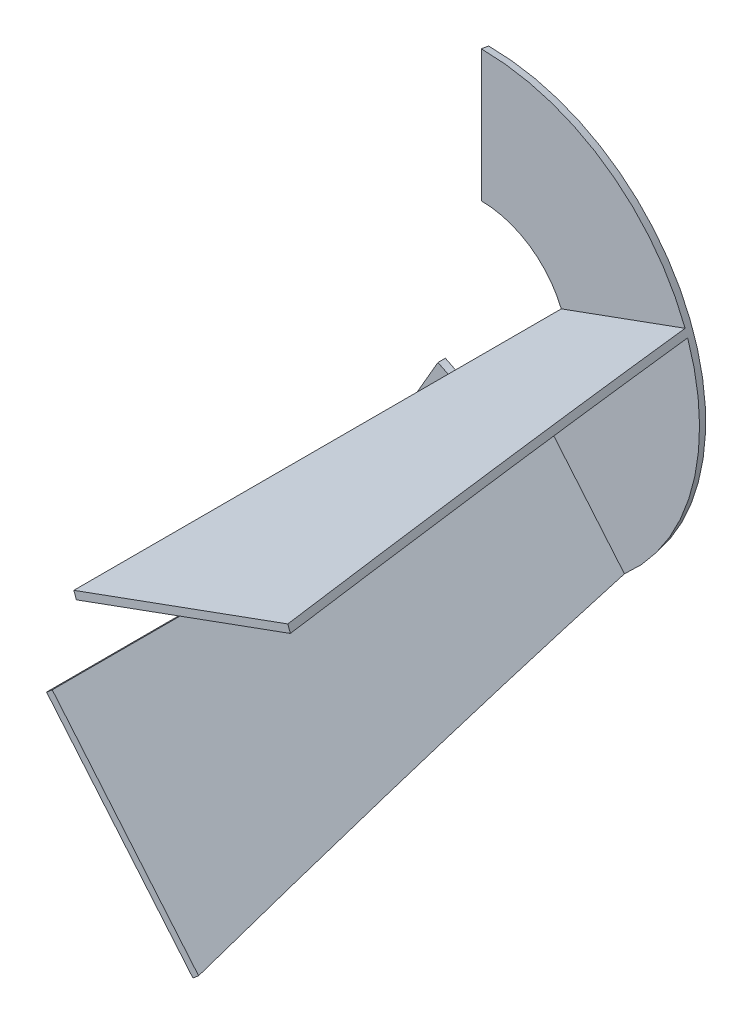
ISO-10303-21;
HEADER;
FILE_DESCRIPTION(('STEP AP214'),'2;1');
FILE_NAME('part.step','',(''),(''),'','','');
FILE_SCHEMA(('AUTOMOTIVE_DESIGN { 1 0 10303 214 1 1 1 1 }'));
ENDSEC;
DATA;
#1=APPLICATION_CONTEXT('core data for automotive mechanical design processes');
#2=APPLICATION_PROTOCOL_DEFINITION('international standard','automotive_design',2000,#1);
#3=PRODUCT_CONTEXT('',#1,'mechanical');
#4=PRODUCT('Part','Part','',(#3));
#5=PRODUCT_RELATED_PRODUCT_CATEGORY('part','',(#4));
#6=PRODUCT_DEFINITION_FORMATION('','',#4);
#7=PRODUCT_DEFINITION_CONTEXT('part definition',#1,'design');
#8=PRODUCT_DEFINITION('design','',#6,#7);
#9=PRODUCT_DEFINITION_SHAPE('','',#8);
#10=(LENGTH_UNIT() NAMED_UNIT(*) SI_UNIT(.MILLI.,.METRE.));
#11=(NAMED_UNIT(*) PLANE_ANGLE_UNIT() SI_UNIT($,.RADIAN.));
#12=(NAMED_UNIT(*) SI_UNIT($,.STERADIAN.) SOLID_ANGLE_UNIT());
#13=UNCERTAINTY_MEASURE_WITH_UNIT(LENGTH_MEASURE(1.E-05),#10,'distance_accuracy_value','');
#14=(GEOMETRIC_REPRESENTATION_CONTEXT(3) GLOBAL_UNCERTAINTY_ASSIGNED_CONTEXT((#13)) GLOBAL_UNIT_ASSIGNED_CONTEXT((#10,
#11,#12)) REPRESENTATION_CONTEXT('',''));
#15=CARTESIAN_POINT('',(0.,0.,0.));
#16=DIRECTION('',(0.,0.,1.));
#17=DIRECTION('',(1.,0.,0.));
#18=AXIS2_PLACEMENT_3D('',#15,#16,#17);
#19=CARTESIAN_POINT('',(-87.4510900266484,6.49566910726212,0.));
#20=CARTESIAN_POINT('',(-125.095140394617,-21.9135996506971,200.));
#21=CARTESIAN_POINT('',(-100.442428241173,-168.406510946035,0.));
#22=CARTESIAN_POINT('',(-81.267941093223,-272.103880439931,200.));
#23=CARTESIAN_POINT('',(74.4597518121241,-181.397849160559,0.));
#24=CARTESIAN_POINT('',(168.922339696011,-228.276681138537,200.));
#25=CARTESIAN_POINT('',(87.4510900266484,-6.49566910726216,0.));
#26=CARTESIAN_POINT('',(125.095140394617,21.913599650697,200.));
#27=CARTESIAN_POINT('',(100.442428241173,168.406510946035,0.));
#28=CARTESIAN_POINT('',(81.2679410932231,272.103880439931,200.));
#29=CARTESIAN_POINT('',(-74.4597518121241,181.397849160559,0.));
#30=CARTESIAN_POINT('',(-168.922339696011,228.276681138537,200.));
#31=CARTESIAN_POINT('',(-87.4510900266484,6.49566910726212,0.));
#32=CARTESIAN_POINT('',(-125.095140394617,-21.9135996506971,200.));
#33=(BOUNDED_SURFACE() B_SPLINE_SURFACE(3,1,((#19,#20),(#21,#22),(#23,#24),(#25,#26),(#27,#28),
(#29,#30),(#31,#32)),.UNSPECIFIED.,.T.,.F.,.F.) B_SPLINE_SURFACE_WITH_KNOTS((4,3,4),(2,2),(0.,
0.5,1.),(0.,1.),.UNSPECIFIED.) GEOMETRIC_REPRESENTATION_ITEM() RATIONAL_B_SPLINE_SURFACE(((1.,
1.),(0.333333333333334,0.333333333333334),(0.333333333333334,0.333333333333334),(1.,1.),
(0.333333333333333,0.333333333333333),(0.333333333333333,0.333333333333333),(1.,1.))) REPRESENTATION_ITEM('') SURFACE());
#34=CARTESIAN_POINT('',(0.,0.,200.));
#35=DIRECTION('',(0.,0.,1.));
#36=DIRECTION('',(1.,0.,0.));
#37=AXIS2_PLACEMENT_3D('',#34,#35,#36);
#38=CIRCLE('',#37,127.);
#39=CARTESIAN_POINT('',(80.479265582188,-98.2450396272079,200.));
#40=VERTEX_POINT('',#39);
#41=CARTESIAN_POINT('',(82.777398911545,-96.3166767981483,200.));
#42=VERTEX_POINT('',#41);
#43=EDGE_CURVE('E305',#40,#42,#38,.T.);
#44=CARTESIAN_POINT('',(80.4792655821881,-98.2450396272079,200.));
#45=CARTESIAN_POINT('',(79.8258986955483,-97.4663872927729,195.15787414735));
#46=CARTESIAN_POINT('',(79.1744886529553,-96.6900670342607,190.315108471509));
#47=CARTESIAN_POINT('',(77.875904815618,-95.1424750808292,180.628190339728));
#48=CARTESIAN_POINT('',(77.2287310313074,-94.3712033983442,175.784037880403));
#49=CARTESIAN_POINT('',(75.9389449465244,-92.834096198126,166.094258801684));
#50=CARTESIAN_POINT('',(75.2963326499015,-92.0682606849805,161.248632181051));
#51=CARTESIAN_POINT('',(74.0160222202433,-90.5424461307995,151.555706284349));
#52=CARTESIAN_POINT('',(73.3783241861355,-89.7824672076612,146.70840697665));
#53=CARTESIAN_POINT('',(72.1082543767335,-88.2688569494609,137.012122894263));
#54=CARTESIAN_POINT('',(71.4758825975654,-87.5152256097822,132.163138120803));
#55=CARTESIAN_POINT('',(70.2169081151739,-86.0148382474076,122.463359330206));
#56=CARTESIAN_POINT('',(69.5903054088664,-85.2680822210364,117.612565314037));
#57=CARTESIAN_POINT('',(67.7936105986119,-83.1268647261203,103.631129904761));
#58=CARTESIAN_POINT('',(66.6314530237928,-81.7418592611689,94.4980162577177));
#59=CARTESIAN_POINT('',(64.3329726262792,-79.0026369899247,76.223994994572));
#60=CARTESIAN_POINT('',(63.1966495743179,-77.6484199104022,67.0830874483839));
#61=CARTESIAN_POINT('',(61.5148886903606,-75.6441753350617,53.3645224337641));
#62=CARTESIAN_POINT('',(60.9580621199263,-74.9805752692946,48.790241122104));
#63=CARTESIAN_POINT('',(59.8526683944306,-73.663218325704,39.6392649211112));
#64=CARTESIAN_POINT('',(59.3041012345709,-73.009461442162,35.0625700331823));
#65=CARTESIAN_POINT('',(58.2159287358204,-71.7126279574139,25.9065269590137));
#66=CARTESIAN_POINT('',(57.6763235368623,-71.069551522973,21.3271787324979));
#67=CARTESIAN_POINT('',(56.6068912000624,-69.7950516935553,12.1657107224982));
#68=CARTESIAN_POINT('',(56.0770640823663,-69.1636283225872,7.58359093332422));
#69=CARTESIAN_POINT('',(55.5525308558803,-68.5385139654875,3.00000000000001));
#70=B_SPLINE_CURVE_WITH_KNOTS('',3,(#44,#45,#46,#47,#48,#49,#50,#51,#52,#53,#54,#55,#56,#57,#58,
#59,#60,#61,#62,#63,#64,#65,#66,#67,#68,#69),.UNSPECIFIED.,.F.,.F.,(4,2,2,2,2,2,2,2,2,2,2,2,4),
(0.,14.8429895337898,29.686015611385,44.5290542137138,59.3723908402982,74.2157166702322,
89.0590345647813,116.990006932346,144.920731331384,158.887470726775,172.854202007863,
186.82115116169,200.788129088241),.UNSPECIFIED.);
#71=CARTESIAN_POINT('',(55.5525308558803,-68.5385139654875,3.));
#72=VERTEX_POINT('',#71);
#73=EDGE_CURVE('E390',#40,#72,#70,.T.);
#74=CARTESIAN_POINT('',(0.,0.,3.));
#75=DIRECTION('',(0.,0.,1.));
#76=DIRECTION('',(1.,0.,0.));
#77=AXIS2_PLACEMENT_3D('',#74,#75,#76);
#78=CIRCLE('',#77,88.2247787250887);
#79=CARTESIAN_POINT('',(-44.1123893625439,-76.4048996191879,3.));
#80=VERTEX_POINT('',#79);
#81=EDGE_CURVE('E394',#72,#80,#78,.F.);
#82=CARTESIAN_POINT('',(-63.4999999999993,-109.985226280624,200.));
#83=CARTESIAN_POINT('',(-62.9918050443149,-109.105006797228,195.157862814135));
#84=CARTESIAN_POINT('',(-62.4851329677572,-108.227425017854,190.315085545337));
#85=CARTESIAN_POINT('',(-61.4750855690972,-106.477971605322,180.628143787621));
#86=CARTESIAN_POINT('',(-60.9717102550489,-105.606099986115,175.783979295344));
#87=CARTESIAN_POINT('',(-59.9685094440528,-103.868505211275,166.094175646622));
#88=CARTESIAN_POINT('',(-59.4686839500642,-103.002782060768,161.24853648895));
#89=CARTESIAN_POINT('',(-58.4728565784787,-101.277958457615,151.555578822597));
#90=CARTESIAN_POINT('',(-57.9768547827149,-100.418858146706,146.708260280281));
#91=CARTESIAN_POINT('',(-56.9889960386355,-98.7078366112596,137.011937090917));
#92=CARTESIAN_POINT('',(-56.4971390873482,-97.8559153815739,132.16293244508));
#93=CARTESIAN_POINT('',(-55.5179147336459,-96.1598490489527,122.46311321015));
#94=CARTESIAN_POINT('',(-55.0305473289263,-95.3157039420254,117.612298621988));
#95=CARTESIAN_POINT('',(-53.6082178048955,-92.8521569412988,103.381928799494));
#96=CARTESIAN_POINT('',(-52.6799050105118,-91.24427201611,93.9997100770592));
#97=CARTESIAN_POINT('',(-50.8445827044154,-88.0654005336864,75.2270194397784));
#98=CARTESIAN_POINT('',(-49.937572989613,-86.4944136246902,65.8365476044983));
#99=CARTESIAN_POINT('',(-48.5958812721245,-84.1705354019058,51.7431632196798));
#100=CARTESIAN_POINT('',(-48.1517648480518,-83.401303190936,47.0438402078543));
#101=CARTESIAN_POINT('',(-47.2703910750344,-81.8747190356112,37.6426233430513));
#102=CARTESIAN_POINT('',(-46.8331337216448,-81.1173670835573,32.9407294917418));
#103=CARTESIAN_POINT('',(-45.9660787641127,-79.6155838441571,23.5341070341163));
#104=CARTESIAN_POINT('',(-45.5362812865867,-78.8711527761173,18.8293783810847));
#105=CARTESIAN_POINT('',(-44.6848466474256,-77.396424721766,9.4169580477619));
#106=CARTESIAN_POINT('',(-44.2632095045406,-76.6661277679309,4.7092663606881));
#107=CARTESIAN_POINT('',(-43.8459999999996,-75.9434997086652,0.));
#108=B_SPLINE_CURVE_WITH_KNOTS('',3,(#82,#83,#84,#85,#86,#87,#88,#89,#90,#91,#92,#93,#94,#95,
#96,#97,#98,#99,#100,#101,#102,#103,#104,#105,#106,#107),.UNSPECIFIED.,.F.,.F.,(4,2,2,2,2,2,2,2,
2,2,2,2,4),(0.,14.8429805767852,29.6859974010277,44.529026597607,59.3723725807232,
74.2157079200028,89.0590356392168,117.751420452957,146.443531621257,160.791105142822,
175.138669366289,189.48647687351,203.834317344135),.UNSPECIFIED.);
#109=CARTESIAN_POINT('',(-43.8459999999996,-75.9434997086652,0.));
#110=VERTEX_POINT('',#109);
#111=EDGE_CURVE('E191',#80,#110,#108,.T.);
#112=CARTESIAN_POINT('',(0.,0.,0.));
#113=DIRECTION('',(0.,0.,1.));
#114=DIRECTION('',(1.,0.,0.));
#115=AXIS2_PLACEMENT_3D('',#112,#113,#114);
#116=CIRCLE('',#115,87.692);
#117=CARTESIAN_POINT('',(1.17799163178258E-13,87.692,0.));
#118=VERTEX_POINT('',#117);
#119=EDGE_CURVE('E221',#110,#118,#116,.T.);
#120=CARTESIAN_POINT('',(0.,127.,200.));
#121=CARTESIAN_POINT('',(0.,125.983610088631,195.157862814135));
#122=CARTESIAN_POINT('',(0.,124.970265935516,190.315085545337));
#123=CARTESIAN_POINT('',(0.,122.950171138196,180.628143787621));
#124=CARTESIAN_POINT('',(0.,121.943420510099,175.783979295344));
#125=CARTESIAN_POINT('',(0.,119.937018888107,166.094175646622));
#126=CARTESIAN_POINT('',(0.,118.93736790013,161.24853648895));
#127=CARTESIAN_POINT('',(0.,116.945713156959,151.555578822597));
#128=CARTESIAN_POINT('',(0.,115.953709565431,146.708260280281));
#129=CARTESIAN_POINT('',(0.,113.977992077272,137.011937090917));
#130=CARTESIAN_POINT('',(0.,112.994278174697,132.16293244508));
#131=CARTESIAN_POINT('',(0.,111.035829467293,122.46311321015));
#132=CARTESIAN_POINT('',(0.,110.061094657854,117.612298621988));
#133=CARTESIAN_POINT('',(0.,107.216435609792,103.381928799494));
#134=CARTESIAN_POINT('',(0.,105.359810021025,93.9997100770591));
#135=CARTESIAN_POINT('',(0.,101.689165408832,75.2270194397784));
#136=CARTESIAN_POINT('',(0.,99.875145979227,65.8365476044983));
#137=CARTESIAN_POINT('',(0.,97.1917625442501,51.7431632196798));
#138=CARTESIAN_POINT('',(0.,96.3035296961046,47.0438402078543));
#139=CARTESIAN_POINT('',(0.,94.5407821500698,37.6426233430513));
#140=CARTESIAN_POINT('',(0.,93.6662674432906,32.9407294917418));
#141=CARTESIAN_POINT('',(0.,91.9321575282263,23.5341070341163));
#142=CARTESIAN_POINT('',(0.,91.0725625731745,18.8293783810847));
#143=CARTESIAN_POINT('',(0.,89.3696932948521,9.4169580477619));
#144=CARTESIAN_POINT('',(0.,88.526419009082,4.7092663606881));
#145=CARTESIAN_POINT('',(1.17799163178258E-13,87.692,0.));
#146=B_SPLINE_CURVE_WITH_KNOTS('',3,(#120,#121,#122,#123,#124,#125,#126,#127,#128,#129,#130,
#131,#132,#133,#134,#135,#136,#137,#138,#139,#140,#141,#142,#143,#144,#145),.UNSPECIFIED.,.F.,
.F.,(4,2,2,2,2,2,2,2,2,2,2,2,4),(0.,14.8429805767853,29.6859974010277,44.529026597607,
59.3723725807232,74.2157079200028,89.0590356392168,117.751420452957,146.443531621257,
160.791105142822,175.138669366289,189.48647687351,203.834317344135),.UNSPECIFIED.);
#147=CARTESIAN_POINT('',(0.,88.2247787250886,3.));
#148=VERTEX_POINT('',#147);
#149=EDGE_CURVE('E224',#148,#118,#146,.T.);
#150=CARTESIAN_POINT('',(0.,0.,3.));
#151=DIRECTION('',(0.,0.,1.));
#152=DIRECTION('',(1.,0.,0.));
#153=AXIS2_PLACEMENT_3D('',#150,#151,#152);
#154=CIRCLE('',#153,88.2247787250886);
#155=CARTESIAN_POINT('',(82.3791599484552,31.5798288038058,3.));
#156=VERTEX_POINT('',#155);
#157=EDGE_CURVE('E352',#148,#156,#154,.F.);
#158=CARTESIAN_POINT('',(118.819608285694,44.8430673218758,200.));
#159=CARTESIAN_POINT('',(117.864449796655,44.4954180628589,195.15787414735));
#160=CARTESIAN_POINT('',(116.912152022233,44.1488100188114,190.315108471509));
#161=CARTESIAN_POINT('',(115.013749453439,43.457847991116,180.628190339728));
#162=CARTESIAN_POINT('',(114.06764467432,43.1134940130198,175.784037880403));
#163=CARTESIAN_POINT('',(112.182103559341,42.4272131716824,166.094258801684));
#164=CARTESIAN_POINT('',(111.242667229109,42.0852863104895,161.248632181051));
#165=CARTESIAN_POINT('',(109.370978595204,41.4040473599338,151.555706284349));
#166=CARTESIAN_POINT('',(108.438726436154,41.0647353232093,146.70840697665));
#167=CARTESIAN_POINT('',(106.582008587532,40.3889452928801,137.012122894263));
#168=CARTESIAN_POINT('',(105.657542892297,40.0524672972143,132.163138120803));
#169=CARTESIAN_POINT('',(103.817045326642,39.3825809670765,122.463359330206));
#170=CARTESIAN_POINT('',(102.901013451714,39.0491726309637,117.612565314037));
#171=CARTESIAN_POINT('',(100.274421355728,38.0931712904659,103.631129904761));
#172=CARTESIAN_POINT('',(98.5754606402588,37.4748001608473,94.4980162577178));
#173=CARTESIAN_POINT('',(95.2153070902893,36.2518042860946,76.223994994572));
#174=CARTESIAN_POINT('',(93.5541139206237,35.64717941897,67.0830874483839));
#175=CARTESIAN_POINT('',(91.0955439843555,34.7523331433066,53.3645224337641));
#176=CARTESIAN_POINT('',(90.2815179959737,34.4560519136165,48.7902411221041));
#177=CARTESIAN_POINT('',(88.6655404767152,33.867884197363,39.6392649211113));
#178=CARTESIAN_POINT('',(87.8635889388238,33.5759977082466,35.0625700331823));
#179=CARTESIAN_POINT('',(86.2727871688322,32.9969932153517,25.9065269590138));
#180=CARTESIAN_POINT('',(85.4839371412999,32.7098752860298,21.3271787324979));
#181=CARTESIAN_POINT('',(83.9205316552938,32.1408422250351,12.1657107224982));
#182=CARTESIAN_POINT('',(83.145976226271,31.8589271040815,7.58359093332422));
#183=CARTESIAN_POINT('',(82.3791599484553,31.5798288038058,3.00000000000001));
#184=B_SPLINE_CURVE_WITH_KNOTS('',3,(#158,#159,#160,#161,#162,#163,#164,#165,#166,#167,#168,
#169,#170,#171,#172,#173,#174,#175,#176,#177,#178,#179,#180,#181,#182,#183),.UNSPECIFIED.,.F.,
.F.,(4,2,2,2,2,2,2,2,2,2,2,2,4),(0.,14.8429895337898,29.686015611385,44.5290542137138,
59.3723908402981,74.2157166702321,89.0590345647812,116.990006932346,144.920731331384,
158.887470726775,172.854202007863,186.82115116169,200.788129088241),.UNSPECIFIED.);
#185=CARTESIAN_POINT('',(118.819608285694,44.8430673218758,200.));
#186=VERTEX_POINT('',#185);
#187=EDGE_CURVE('E350',#186,#156,#184,.T.);
#188=CARTESIAN_POINT('',(119.845668715671,42.0239894595181,200.));
#189=VERTEX_POINT('',#188);
#190=EDGE_CURVE('E290',#189,#186,#38,.T.);
#191=CARTESIAN_POINT('',(119.845668715671,42.0239894595181,200.));
#192=CARTESIAN_POINT('',(118.890510226632,41.6763402005012,195.15787414735));
#193=CARTESIAN_POINT('',(117.93821245221,41.3297321564537,190.315108471509));
#194=CARTESIAN_POINT('',(116.039809883416,40.6387701287583,180.628190339728));
#195=CARTESIAN_POINT('',(115.093705104297,40.294416150662,175.784037880403));
#196=CARTESIAN_POINT('',(113.208163989318,39.6081353093246,166.094258801684));
#197=CARTESIAN_POINT('',(112.268727659086,39.2662084481318,161.248632181051));
#198=CARTESIAN_POINT('',(110.397039025181,38.5849694975761,151.555706284349));
#199=CARTESIAN_POINT('',(109.464786866131,38.2456574608515,146.70840697665));
#200=CARTESIAN_POINT('',(107.608069017509,37.5698674305224,137.012122894263));
#201=CARTESIAN_POINT('',(106.683603322274,37.2333894348565,132.163138120803));
#202=CARTESIAN_POINT('',(104.843105756619,36.5635031047188,122.463359330206));
#203=CARTESIAN_POINT('',(103.927073881691,36.230094768606,117.612565314037));
#204=CARTESIAN_POINT('',(101.300481785705,35.2740934281082,103.631129904761));
#205=CARTESIAN_POINT('',(99.6015210702358,34.6557222984896,94.4980162577177));
#206=CARTESIAN_POINT('',(96.2413675202663,33.4327264237368,76.223994994572));
#207=CARTESIAN_POINT('',(94.5801743506007,32.8281015566122,67.0830874483839));
#208=CARTESIAN_POINT('',(92.1216044143325,31.9332552809489,53.3645224337641));
#209=CARTESIAN_POINT('',(91.3075784259507,31.6369740512588,48.790241122104));
#210=CARTESIAN_POINT('',(89.6916009066922,31.0488063350053,39.6392649211113));
#211=CARTESIAN_POINT('',(88.8896493688008,30.7569198458888,35.0625700331823));
#212=CARTESIAN_POINT('',(87.2988475988092,30.1779153529939,25.9065269590137));
#213=CARTESIAN_POINT('',(86.5099975712769,29.8907974236721,21.3271787324979));
#214=CARTESIAN_POINT('',(84.9465920852708,29.3217643626774,12.1657107224982));
#215=CARTESIAN_POINT('',(84.172036656248,29.0398492417238,7.58359093332423));
#216=CARTESIAN_POINT('',(83.4052203784323,28.7607509414481,3.00000000000001));
#217=B_SPLINE_CURVE_WITH_KNOTS('',3,(#191,#192,#193,#194,#195,#196,#197,#198,#199,#200,#201,
#202,#203,#204,#205,#206,#207,#208,#209,#210,#211,#212,#213,#214,#215,#216),.UNSPECIFIED.,.F.,
.F.,(4,2,2,2,2,2,2,2,2,2,2,2,4),(0.,14.8429895337898,29.686015611385,44.5290542137138,
59.3723908402981,74.2157166702321,89.0590345647812,116.990006932346,144.920731331384,
158.887470726775,172.854202007863,186.82115116169,200.788129088241),.UNSPECIFIED.);
#218=CARTESIAN_POINT('',(83.4052203784322,28.7607509414481,3.));
#219=VERTEX_POINT('',#218);
#220=EDGE_CURVE('E315',#189,#219,#217,.T.);
#221=CARTESIAN_POINT('',(0.,0.,3.));
#222=DIRECTION('',(0.,0.,1.));
#223=DIRECTION('',(1.,0.,0.));
#224=AXIS2_PLACEMENT_3D('',#221,#222,#223);
#225=CIRCLE('',#224,88.2247787250886);
#226=CARTESIAN_POINT('',(57.8506641852373,-66.6101511364279,3.));
#227=VERTEX_POINT('',#226);
#228=EDGE_CURVE('E307',#219,#227,#225,.F.);
#229=CARTESIAN_POINT('',(82.777398911545,-96.3166767981483,200.));
#230=CARTESIAN_POINT('',(82.1240320249052,-95.5380244637133,195.15787414735));
#231=CARTESIAN_POINT('',(81.4726219823122,-94.7617042052011,190.315108471509));
#232=CARTESIAN_POINT('',(80.1740381449749,-93.2141122517695,180.628190339728));
#233=CARTESIAN_POINT('',(79.5268643606643,-92.4428405692846,175.784037880403));
#234=CARTESIAN_POINT('',(78.2370782758813,-90.9057333690664,166.094258801684));
#235=CARTESIAN_POINT('',(77.5944659792585,-90.1398978559209,161.248632181051));
#236=CARTESIAN_POINT('',(76.3141555496002,-88.6140833017399,151.555706284349));
#237=CARTESIAN_POINT('',(75.6764575154924,-87.8541043786016,146.70840697665));
#238=CARTESIAN_POINT('',(74.4063877060904,-86.3404941204013,137.012122894263));
#239=CARTESIAN_POINT('',(73.7740159269224,-85.5868627807226,132.163138120803));
#240=CARTESIAN_POINT('',(72.5150414445309,-84.086475418348,122.463359330206));
#241=CARTESIAN_POINT('',(71.8884387382234,-83.3397193919768,117.612565314037));
#242=CARTESIAN_POINT('',(70.0917439279689,-81.1985018970607,103.631129904761));
#243=CARTESIAN_POINT('',(68.9295863531497,-79.8134964321093,94.4980162577177));
#244=CARTESIAN_POINT('',(66.6311059556361,-77.074274160865,76.223994994572));
#245=CARTESIAN_POINT('',(65.4947829036748,-75.7200570813425,67.0830874483839));
#246=CARTESIAN_POINT('',(63.8130220197176,-73.7158125060021,53.3645224337641));
#247=CARTESIAN_POINT('',(63.2561954492833,-73.0522124402351,48.790241122104));
#248=CARTESIAN_POINT('',(62.1508017237875,-71.7348554966444,39.6392649211112));
#249=CARTESIAN_POINT('',(61.6022345639278,-71.0810986131024,35.0625700331823));
#250=CARTESIAN_POINT('',(60.5140620651774,-69.7842651283543,25.9065269590137));
#251=CARTESIAN_POINT('',(59.9744568662192,-69.1411886939134,21.3271787324979));
#252=CARTESIAN_POINT('',(58.9050245294194,-67.8666888644957,12.1657107224982));
#253=CARTESIAN_POINT('',(58.3751974117233,-67.2352654935276,7.58359093332421));
#254=CARTESIAN_POINT('',(57.8506641852373,-66.6101511364279,2.99999999999999));
#255=B_SPLINE_CURVE_WITH_KNOTS('',3,(#229,#230,#231,#232,#233,#234,#235,#236,#237,#238,#239,
#240,#241,#242,#243,#244,#245,#246,#247,#248,#249,#250,#251,#252,#253,#254),.UNSPECIFIED.,.F.,
.F.,(4,2,2,2,2,2,2,2,2,2,2,2,4),(0.,14.8429895337898,29.686015611385,44.5290542137138,
59.3723908402982,74.2157166702322,89.0590345647813,116.990006932346,144.920731331384,
158.887470726775,172.854202007863,186.82115116169,200.788129088241),.UNSPECIFIED.);
#256=EDGE_CURVE('E312',#42,#227,#255,.T.);
#257=ORIENTED_EDGE('',*,*,#43,.F.);
#258=ORIENTED_EDGE('',*,*,#73,.T.);
#259=ORIENTED_EDGE('',*,*,#81,.T.);
#260=ORIENTED_EDGE('',*,*,#111,.T.);
#261=ORIENTED_EDGE('',*,*,#119,.T.);
#262=ORIENTED_EDGE('',*,*,#149,.F.);
#263=ORIENTED_EDGE('',*,*,#157,.T.);
#264=ORIENTED_EDGE('',*,*,#187,.F.);
#265=ORIENTED_EDGE('',*,*,#190,.F.);
#266=ORIENTED_EDGE('',*,*,#220,.T.);
#267=ORIENTED_EDGE('',*,*,#228,.T.);
#268=ORIENTED_EDGE('',*,*,#256,.F.);
#269=EDGE_LOOP('',(#257,#258,#259,#260,#261,#262,#263,#264,#265,#266,#267,#268));
#270=FACE_BOUND('',#269,.T.);
#271=ADVANCED_FACE('F85',(#270),#33,.T.);
#272=CARTESIAN_POINT('',(0.,0.,-85.));
#273=DIRECTION('',(0.,0.,1.));
#274=DIRECTION('',(1.,0.,0.));
#275=AXIS2_PLACEMENT_3D('',#272,#273,#274);
#276=CYLINDRICAL_SURFACE('',#275,35.);
#277=DIRECTION('',(0.,0.,1.));
#278=VECTOR('',#277,1.);
#279=CARTESIAN_POINT('',(21.3278291481083,-27.7511027497846,3.));
#280=LINE('',#279,#278);
#281=CARTESIAN_POINT('',(21.3278291481083,-27.7511027497846,3.));
#282=VERTEX_POINT('',#281);
#283=CARTESIAN_POINT('',(21.3278291481083,-27.7511027497846,200.));
#284=VERTEX_POINT('',#283);
#285=EDGE_CURVE('E192',#282,#284,#280,.T.);
#286=ORIENTED_EDGE('',*,*,#285,.T.);
#287=CARTESIAN_POINT('',(0.,0.,200.));
#288=DIRECTION('',(0.,0.,1.));
#289=DIRECTION('',(1.,0.,0.));
#290=AXIS2_PLACEMENT_3D('',#287,#288,#289);
#291=CIRCLE('',#290,35.);
#292=CARTESIAN_POINT('',(23.6259624774653,-25.822739920725,200.));
#293=VERTEX_POINT('',#292);
#294=EDGE_CURVE('E204',#284,#293,#291,.T.);
#295=ORIENTED_EDGE('',*,*,#294,.T.);
#296=DIRECTION('',(0.,0.,1.));
#297=VECTOR('',#296,1.);
#298=CARTESIAN_POINT('',(23.6259624774653,-25.822739920725,3.));
#299=LINE('',#298,#297);
#300=CARTESIAN_POINT('',(23.6259624774653,-25.822739920725,3.));
#301=VERTEX_POINT('',#300);
#302=EDGE_CURVE('E298',#301,#293,#299,.T.);
#303=ORIENTED_EDGE('',*,*,#302,.F.);
#304=CARTESIAN_POINT('',(0.,0.,3.));
#305=DIRECTION('',(0.,0.,1.));
#306=DIRECTION('',(1.,0.,0.));
#307=AXIS2_PLACEMENT_3D('',#304,#305,#306);
#308=CIRCLE('',#307,35.);
#309=CARTESIAN_POINT('',(33.3720536547054,10.5501675279334,3.));
#310=VERTEX_POINT('',#309);
#311=EDGE_CURVE('E392',#310,#301,#308,.F.);
#312=ORIENTED_EDGE('',*,*,#311,.F.);
#313=DIRECTION('',(0.,0.,1.));
#314=VECTOR('',#313,1.);
#315=CARTESIAN_POINT('',(33.3720536547054,10.5501675279334,3.));
#316=LINE('',#315,#314);
#317=CARTESIAN_POINT('',(33.3720536547054,10.5501675279334,200.));
#318=VERTEX_POINT('',#317);
#319=EDGE_CURVE('E301',#310,#318,#316,.T.);
#320=ORIENTED_EDGE('',*,*,#319,.T.);
#321=CARTESIAN_POINT('',(32.3459932247285,13.3692453902912,200.));
#322=VERTEX_POINT('',#321);
#323=EDGE_CURVE('E292',#318,#322,#291,.T.);
#324=ORIENTED_EDGE('',*,*,#323,.T.);
#325=DIRECTION('',(0.,0.,1.));
#326=VECTOR('',#325,1.);
#327=CARTESIAN_POINT('',(32.3459932247285,13.3692453902912,3.));
#328=LINE('',#327,#326);
#329=CARTESIAN_POINT('',(32.3459932247285,13.3692453902912,3.));
#330=VERTEX_POINT('',#329);
#331=EDGE_CURVE('E355',#330,#322,#328,.T.);
#332=ORIENTED_EDGE('',*,*,#331,.F.);
#333=CARTESIAN_POINT('',(0.,0.,3.));
#334=DIRECTION('',(0.,0.,1.));
#335=DIRECTION('',(1.,0.,0.));
#336=AXIS2_PLACEMENT_3D('',#333,#334,#335);
#337=CIRCLE('',#336,35.);
#338=CARTESIAN_POINT('',(0.,35.,3.));
#339=VERTEX_POINT('',#338);
#340=EDGE_CURVE('E359',#339,#330,#337,.F.);
#341=ORIENTED_EDGE('',*,*,#340,.F.);
#342=DIRECTION('',(0.,0.,1.));
#343=VECTOR('',#342,1.);
#344=CARTESIAN_POINT('',(0.,35.,-85.));
#345=LINE('',#344,#343);
#346=CARTESIAN_POINT('',(0.,35.,0.));
#347=VERTEX_POINT('',#346);
#348=EDGE_CURVE('E198',#347,#339,#345,.T.);
#349=ORIENTED_EDGE('',*,*,#348,.F.);
#350=CARTESIAN_POINT('',(0.,0.,0.));
#351=DIRECTION('',(0.,0.,1.));
#352=DIRECTION('',(1.,0.,0.));
#353=AXIS2_PLACEMENT_3D('',#350,#351,#352);
#354=CIRCLE('',#353,35.);
#355=CARTESIAN_POINT('',(-17.4999999999998,-30.3108891324555,0.));
#356=VERTEX_POINT('',#355);
#357=EDGE_CURVE('E95',#356,#347,#354,.T.);
#358=ORIENTED_EDGE('',*,*,#357,.F.);
#359=DIRECTION('',(0.,0.,1.));
#360=VECTOR('',#359,1.);
#361=CARTESIAN_POINT('',(-17.4999999999998,-30.3108891324555,-85.));
#362=LINE('',#361,#360);
#363=CARTESIAN_POINT('',(-17.4999999999998,-30.3108891324555,3.));
#364=VERTEX_POINT('',#363);
#365=EDGE_CURVE('E189',#356,#364,#362,.T.);
#366=ORIENTED_EDGE('',*,*,#365,.T.);
#367=CARTESIAN_POINT('',(0.,0.,3.));
#368=DIRECTION('',(0.,0.,1.));
#369=DIRECTION('',(1.,0.,0.));
#370=AXIS2_PLACEMENT_3D('',#367,#368,#369);
#371=CIRCLE('',#370,35.);
#372=EDGE_CURVE('E175',#282,#364,#371,.F.);
#373=ORIENTED_EDGE('',*,*,#372,.F.);
#374=EDGE_LOOP('',(#286,#295,#303,#312,#320,#324,#332,#341,#349,#358,#366,#373));
#375=FACE_BOUND('',#374,.T.);
#376=ADVANCED_FACE('F194',(#375),#276,.F.);
#377=CARTESIAN_POINT('',(0.,0.,200.));
#378=DIRECTION('',(0.,0.,1.));
#379=DIRECTION('',(1.,0.,0.));
#380=AXIS2_PLACEMENT_3D('',#377,#378,#379);
#381=PLANE('',#380);
#382=ORIENTED_EDGE('',*,*,#294,.F.);
#383=DIRECTION('',(0.642787609686535,-0.766044443118982,0.));
#384=VECTOR('',#383,1.);
#385=CARTESIAN_POINT('',(-1.14906666467848,-0.96418141452981,200.));
#386=LINE('',#385,#384);
#387=EDGE_CURVE('E429',#284,#40,#386,.T.);
#388=ORIENTED_EDGE('',*,*,#387,.T.);
#389=ORIENTED_EDGE('',*,*,#43,.T.);
#390=DIRECTION('',(0.642787609686535,-0.766044443118982,0.));
#391=VECTOR('',#390,1.);
#392=CARTESIAN_POINT('',(1.14906666467847,0.964181414529804,200.));
#393=LINE('',#392,#391);
#394=EDGE_CURVE('E386',#293,#42,#393,.T.);
#395=ORIENTED_EDGE('',*,*,#394,.F.);
#396=EDGE_LOOP('',(#382,#388,#389,#395));
#397=FACE_BOUND('',#396,.T.);
#398=ADVANCED_FACE('F87',(#397),#381,.T.);
#399=ORIENTED_EDGE('',*,*,#323,.F.);
#400=DIRECTION('',(0.93969262078591,0.342020143325666,0.));
#401=VECTOR('',#400,1.);
#402=CARTESIAN_POINT('',(0.5130302149885,-1.40953893117887,200.));
#403=LINE('',#402,#401);
#404=EDGE_CURVE('E379',#318,#189,#403,.T.);
#405=ORIENTED_EDGE('',*,*,#404,.T.);
#406=ORIENTED_EDGE('',*,*,#190,.T.);
#407=DIRECTION('',(0.93969262078591,0.342020143325666,0.));
#408=VECTOR('',#407,1.);
#409=CARTESIAN_POINT('',(-0.513030214988498,1.40953893117886,200.));
#410=LINE('',#409,#408);
#411=EDGE_CURVE('E358',#322,#186,#410,.T.);
#412=ORIENTED_EDGE('',*,*,#411,.F.);
#413=EDGE_LOOP('',(#399,#405,#406,#412));
#414=FACE_BOUND('',#413,.T.);
#415=ADVANCED_FACE('F251',(#414),#381,.T.);
#416=CARTESIAN_POINT('',(0.,0.,-85.));
#417=DIRECTION('',(1.,0.,0.));
#418=DIRECTION('',(0.,0.,-1.));
#419=AXIS2_PLACEMENT_3D('',#416,#417,#418);
#420=PLANE('',#419);
#421=DIRECTION('',(0.,-1.,0.));
#422=VECTOR('',#421,1.);
#423=CARTESIAN_POINT('',(0.,0.,3.));
#424=LINE('',#423,#422);
#425=EDGE_CURVE('E12',#148,#339,#424,.T.);
#426=ORIENTED_EDGE('',*,*,#425,.F.);
#427=ORIENTED_EDGE('',*,*,#149,.T.);
#428=DIRECTION('',(0.,1.,0.));
#429=VECTOR('',#428,1.);
#430=CARTESIAN_POINT('',(0.,0.,0.));
#431=LINE('',#430,#429);
#432=EDGE_CURVE('E197',#347,#118,#431,.T.);
#433=ORIENTED_EDGE('',*,*,#432,.F.);
#434=ORIENTED_EDGE('',*,*,#348,.T.);
#435=EDGE_LOOP('',(#426,#427,#433,#434));
#436=FACE_BOUND('',#435,.T.);
#437=ADVANCED_FACE('F246',(#436),#420,.F.);
#438=CARTESIAN_POINT('',(0.,0.,0.));
#439=DIRECTION('',(0.,0.,1.));
#440=DIRECTION('',(1.,0.,0.));
#441=AXIS2_PLACEMENT_3D('',#438,#439,#440);
#442=PLANE('',#441);
#443=DIRECTION('',(-0.499999999999995,-0.866025403784442,0.));
#444=VECTOR('',#443,1.);
#445=CARTESIAN_POINT('',(0.,0.,0.));
#446=LINE('',#445,#444);
#447=EDGE_CURVE('E201',#356,#110,#446,.T.);
#448=ORIENTED_EDGE('',*,*,#447,.F.);
#449=ORIENTED_EDGE('',*,*,#357,.T.);
#450=ORIENTED_EDGE('',*,*,#432,.T.);
#451=ORIENTED_EDGE('',*,*,#119,.F.);
#452=EDGE_LOOP('',(#448,#449,#450,#451));
#453=FACE_BOUND('',#452,.T.);
#454=ADVANCED_FACE('F250',(#453),#442,.F.);
#455=CARTESIAN_POINT('',(0.,0.,-85.));
#456=DIRECTION('',(-0.866025403784442,0.499999999999995,0.));
#457=DIRECTION('',(-0.499999999999995,-0.866025403784442,0.));
#458=AXIS2_PLACEMENT_3D('',#455,#456,#457);
#459=PLANE('',#458);
#460=DIRECTION('',(-0.499999999999995,-0.866025403784442,0.));
#461=VECTOR('',#460,1.);
#462=CARTESIAN_POINT('',(0.,0.,3.));
#463=LINE('',#462,#461);
#464=EDGE_CURVE('E178',#364,#80,#463,.T.);
#465=ORIENTED_EDGE('',*,*,#464,.F.);
#466=ORIENTED_EDGE('',*,*,#365,.F.);
#467=ORIENTED_EDGE('',*,*,#447,.T.);
#468=ORIENTED_EDGE('',*,*,#111,.F.);
#469=EDGE_LOOP('',(#465,#466,#467,#468));
#470=FACE_BOUND('',#469,.T.);
#471=ADVANCED_FACE('F187',(#470),#459,.T.);
#472=CARTESIAN_POINT('',(-0.513030214988498,1.40953893117886,3.));
#473=DIRECTION('',(0.342020143325666,-0.939692620785909,0.));
#474=DIRECTION('',(0.939692620785909,0.342020143325666,0.));
#475=AXIS2_PLACEMENT_3D('',#472,#473,#474);
#476=PLANE('',#475);
#477=ORIENTED_EDGE('',*,*,#187,.T.);
#478=DIRECTION('',(0.93969262078591,0.342020143325666,0.));
#479=VECTOR('',#478,1.);
#480=CARTESIAN_POINT('',(-0.513030214988498,1.40953893117886,3.));
#481=LINE('',#480,#479);
#482=EDGE_CURVE('E364',#330,#156,#481,.T.);
#483=ORIENTED_EDGE('',*,*,#482,.F.);
#484=ORIENTED_EDGE('',*,*,#331,.T.);
#485=ORIENTED_EDGE('',*,*,#411,.T.);
#486=EDGE_LOOP('',(#477,#483,#484,#485));
#487=FACE_BOUND('',#486,.T.);
#488=ADVANCED_FACE('F340',(#487),#476,.F.);
#489=CARTESIAN_POINT('',(0.,0.,3.));
#490=DIRECTION('',(0.,0.,1.));
#491=DIRECTION('',(1.,0.,0.));
#492=AXIS2_PLACEMENT_3D('',#489,#490,#491);
#493=PLANE('',#492);
#494=ORIENTED_EDGE('',*,*,#425,.T.);
#495=ORIENTED_EDGE('',*,*,#340,.T.);
#496=ORIENTED_EDGE('',*,*,#482,.T.);
#497=ORIENTED_EDGE('',*,*,#157,.F.);
#498=EDGE_LOOP('',(#494,#495,#496,#497));
#499=FACE_BOUND('',#498,.T.);
#500=ADVANCED_FACE('F338',(#499),#493,.T.);
#501=CARTESIAN_POINT('',(0.5130302149885,-1.40953893117887,3.));
#502=DIRECTION('',(0.342020143325666,-0.939692620785909,0.));
#503=DIRECTION('',(0.939692620785909,0.342020143325666,0.));
#504=AXIS2_PLACEMENT_3D('',#501,#502,#503);
#505=PLANE('',#504);
#506=ORIENTED_EDGE('',*,*,#404,.F.);
#507=ORIENTED_EDGE('',*,*,#319,.F.);
#508=DIRECTION('',(0.93969262078591,0.342020143325666,0.));
#509=VECTOR('',#508,1.);
#510=CARTESIAN_POINT('',(0.5130302149885,-1.40953893117887,3.));
#511=LINE('',#510,#509);
#512=EDGE_CURVE('E111',#310,#219,#511,.T.);
#513=ORIENTED_EDGE('',*,*,#512,.T.);
#514=ORIENTED_EDGE('',*,*,#220,.F.);
#515=EDGE_LOOP('',(#506,#507,#513,#514));
#516=FACE_BOUND('',#515,.T.);
#517=ADVANCED_FACE('F334',(#516),#505,.T.);
#518=CARTESIAN_POINT('',(1.14906666467847,0.964181414529804,3.));
#519=DIRECTION('',(-0.766044443118982,-0.642787609686535,0.));
#520=DIRECTION('',(0.642787609686535,-0.766044443118982,0.));
#521=AXIS2_PLACEMENT_3D('',#518,#519,#520);
#522=PLANE('',#521);
#523=ORIENTED_EDGE('',*,*,#256,.T.);
#524=DIRECTION('',(0.642787609686535,-0.766044443118982,0.));
#525=VECTOR('',#524,1.);
#526=CARTESIAN_POINT('',(1.14906666467847,0.964181414529804,3.));
#527=LINE('',#526,#525);
#528=EDGE_CURVE('E388',#301,#227,#527,.T.);
#529=ORIENTED_EDGE('',*,*,#528,.F.);
#530=ORIENTED_EDGE('',*,*,#302,.T.);
#531=ORIENTED_EDGE('',*,*,#394,.T.);
#532=EDGE_LOOP('',(#523,#529,#530,#531));
#533=FACE_BOUND('',#532,.T.);
#534=ADVANCED_FACE('F328',(#533),#522,.F.);
#535=CARTESIAN_POINT('',(0.,0.,3.));
#536=DIRECTION('',(0.,0.,1.));
#537=DIRECTION('',(1.,0.,0.));
#538=AXIS2_PLACEMENT_3D('',#535,#536,#537);
#539=PLANE('',#538);
#540=ORIENTED_EDGE('',*,*,#512,.F.);
#541=ORIENTED_EDGE('',*,*,#311,.T.);
#542=ORIENTED_EDGE('',*,*,#528,.T.);
#543=ORIENTED_EDGE('',*,*,#228,.F.);
#544=EDGE_LOOP('',(#540,#541,#542,#543));
#545=FACE_BOUND('',#544,.T.);
#546=ADVANCED_FACE('F333',(#545),#539,.T.);
#547=CARTESIAN_POINT('',(-1.14906666467848,-0.96418141452981,3.));
#548=DIRECTION('',(-0.766044443118982,-0.642787609686535,0.));
#549=DIRECTION('',(0.642787609686535,-0.766044443118982,0.));
#550=AXIS2_PLACEMENT_3D('',#547,#548,#549);
#551=PLANE('',#550);
#552=ORIENTED_EDGE('',*,*,#387,.F.);
#553=ORIENTED_EDGE('',*,*,#285,.F.);
#554=DIRECTION('',(0.642787609686535,-0.766044443118982,0.));
#555=VECTOR('',#554,1.);
#556=CARTESIAN_POINT('',(-1.14906666467848,-0.96418141452981,3.));
#557=LINE('',#556,#555);
#558=EDGE_CURVE('E103',#282,#72,#557,.T.);
#559=ORIENTED_EDGE('',*,*,#558,.T.);
#560=ORIENTED_EDGE('',*,*,#73,.F.);
#561=EDGE_LOOP('',(#552,#553,#559,#560));
#562=FACE_BOUND('',#561,.T.);
#563=ADVANCED_FACE('F412',(#562),#551,.T.);
#564=CARTESIAN_POINT('',(0.,0.,3.));
#565=DIRECTION('',(0.,0.,1.));
#566=DIRECTION('',(1.,0.,0.));
#567=AXIS2_PLACEMENT_3D('',#564,#565,#566);
#568=PLANE('',#567);
#569=ORIENTED_EDGE('',*,*,#558,.F.);
#570=ORIENTED_EDGE('',*,*,#372,.T.);
#571=ORIENTED_EDGE('',*,*,#464,.T.);
#572=ORIENTED_EDGE('',*,*,#81,.F.);
#573=EDGE_LOOP('',(#569,#570,#571,#572));
#574=FACE_BOUND('',#573,.T.);
#575=ADVANCED_FACE('F177',(#574),#568,.T.);
#576=CLOSED_SHELL('',(#271,#376,#398,#415,#437,#454,#471,#488,#500,#517,#534,#546,#563,#575));
#577=MANIFOLD_SOLID_BREP('B2',#576);
#578=ADVANCED_BREP_SHAPE_REPRESENTATION('',(#18,#577),#14);
#579=SHAPE_DEFINITION_REPRESENTATION(#9,#578);
ENDSEC;
END-ISO-10303-21;
